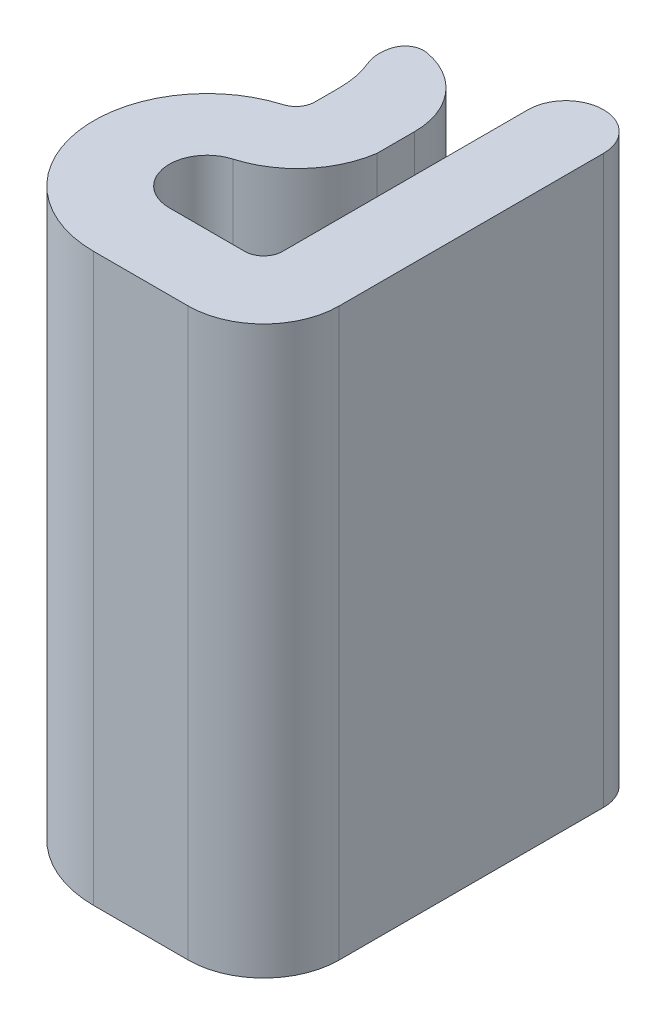
ISO-10303-21;
HEADER;
FILE_DESCRIPTION(('STEP AP214'),'2;1');
FILE_NAME('part.step','',(''),(''),'','','');
FILE_SCHEMA(('AUTOMOTIVE_DESIGN { 1 0 10303 214 1 1 1 1 }'));
ENDSEC;
DATA;
#1=APPLICATION_CONTEXT('core data for automotive mechanical design processes');
#2=APPLICATION_PROTOCOL_DEFINITION('international standard','automotive_design',2000,#1);
#3=PRODUCT_CONTEXT('',#1,'mechanical');
#4=PRODUCT('Part','Part','',(#3));
#5=PRODUCT_RELATED_PRODUCT_CATEGORY('part','',(#4));
#6=PRODUCT_DEFINITION_FORMATION('','',#4);
#7=PRODUCT_DEFINITION_CONTEXT('part definition',#1,'design');
#8=PRODUCT_DEFINITION('design','',#6,#7);
#9=PRODUCT_DEFINITION_SHAPE('','',#8);
#10=(LENGTH_UNIT() NAMED_UNIT(*) SI_UNIT(.MILLI.,.METRE.));
#11=(NAMED_UNIT(*) PLANE_ANGLE_UNIT() SI_UNIT($,.RADIAN.));
#12=(NAMED_UNIT(*) SI_UNIT($,.STERADIAN.) SOLID_ANGLE_UNIT());
#13=UNCERTAINTY_MEASURE_WITH_UNIT(LENGTH_MEASURE(1.E-05),#10,'distance_accuracy_value','');
#14=(GEOMETRIC_REPRESENTATION_CONTEXT(3) GLOBAL_UNCERTAINTY_ASSIGNED_CONTEXT((#13)) GLOBAL_UNIT_ASSIGNED_CONTEXT((#10,
#11,#12)) REPRESENTATION_CONTEXT('',''));
#15=CARTESIAN_POINT('',(0.,0.,0.));
#16=DIRECTION('',(0.,0.,1.));
#17=DIRECTION('',(1.,0.,0.));
#18=AXIS2_PLACEMENT_3D('',#15,#16,#17);
#19=CARTESIAN_POINT('',(33.25,24.,39.));
#20=DIRECTION('',(-1.,0.,0.));
#21=DIRECTION('',(0.,-1.,0.));
#22=AXIS2_PLACEMENT_3D('',#19,#20,#21);
#23=PLANE('',#22);
#24=DIRECTION('',(0.,0.,-1.));
#25=VECTOR('',#24,1.);
#26=CARTESIAN_POINT('',(33.25,24.,39.));
#27=LINE('',#26,#25);
#28=CARTESIAN_POINT('',(33.25,24.,39.));
#29=VERTEX_POINT('',#28);
#30=CARTESIAN_POINT('',(33.25,24.,32.5));
#31=VERTEX_POINT('',#30);
#32=EDGE_CURVE('E180',#29,#31,#27,.T.);
#33=ORIENTED_EDGE('',*,*,#32,.T.);
#34=DIRECTION('',(0.,-1.,0.));
#35=VECTOR('',#34,1.);
#36=CARTESIAN_POINT('',(33.25,24.,32.5));
#37=LINE('',#36,#35);
#38=CARTESIAN_POINT('',(33.25,9.,32.5));
#39=VERTEX_POINT('',#38);
#40=EDGE_CURVE('E294',#31,#39,#37,.T.);
#41=ORIENTED_EDGE('',*,*,#40,.T.);
#42=DIRECTION('',(0.,0.,-1.));
#43=VECTOR('',#42,1.);
#44=CARTESIAN_POINT('',(33.25,9.,39.));
#45=LINE('',#44,#43);
#46=CARTESIAN_POINT('',(33.25,9.,39.));
#47=VERTEX_POINT('',#46);
#48=EDGE_CURVE('E216',#47,#39,#45,.T.);
#49=ORIENTED_EDGE('',*,*,#48,.F.);
#50=DIRECTION('',(0.,-1.,0.));
#51=VECTOR('',#50,1.);
#52=CARTESIAN_POINT('',(33.25,24.,39.));
#53=LINE('',#52,#51);
#54=EDGE_CURVE('E256',#29,#47,#53,.T.);
#55=ORIENTED_EDGE('',*,*,#54,.F.);
#56=EDGE_LOOP('',(#33,#41,#49,#55));
#57=FACE_BOUND('',#56,.T.);
#58=ADVANCED_FACE('F35',(#57),#23,.T.);
#59=CARTESIAN_POINT('',(32.75,24.,39.));
#60=DIRECTION('',(0.,-1.,0.));
#61=DIRECTION('',(1.,0.,0.));
#62=AXIS2_PLACEMENT_3D('',#59,#60,#61);
#63=CYLINDRICAL_SURFACE('',#62,0.5);
#64=ORIENTED_EDGE('',*,*,#54,.T.);
#65=CARTESIAN_POINT('',(32.75,9.,39.));
#66=DIRECTION('',(0.,1.,0.));
#67=DIRECTION('',(1.,0.,0.));
#68=AXIS2_PLACEMENT_3D('',#65,#66,#67);
#69=CIRCLE('',#68,0.5);
#70=CARTESIAN_POINT('',(32.75,9.,39.5));
#71=VERTEX_POINT('',#70);
#72=EDGE_CURVE('E213',#71,#47,#69,.T.);
#73=ORIENTED_EDGE('',*,*,#72,.F.);
#74=DIRECTION('',(0.,-1.,0.));
#75=VECTOR('',#74,1.);
#76=CARTESIAN_POINT('',(32.75,24.,39.5));
#77=LINE('',#76,#75);
#78=CARTESIAN_POINT('',(32.75,24.,39.5));
#79=VERTEX_POINT('',#78);
#80=EDGE_CURVE('E259',#79,#71,#77,.T.);
#81=ORIENTED_EDGE('',*,*,#80,.F.);
#82=CARTESIAN_POINT('',(32.75,24.,39.));
#83=DIRECTION('',(0.,1.,0.));
#84=DIRECTION('',(1.,0.,0.));
#85=AXIS2_PLACEMENT_3D('',#82,#83,#84);
#86=CIRCLE('',#85,0.5);
#87=EDGE_CURVE('E251',#79,#29,#86,.T.);
#88=ORIENTED_EDGE('',*,*,#87,.T.);
#89=EDGE_LOOP('',(#64,#73,#81,#88));
#90=FACE_BOUND('',#89,.T.);
#91=ADVANCED_FACE('F338',(#90),#63,.F.);
#92=CARTESIAN_POINT('',(30.7500000000001,24.,39.5));
#93=DIRECTION('',(0.,0.,-1.));
#94=DIRECTION('',(-1.,0.,0.));
#95=AXIS2_PLACEMENT_3D('',#92,#93,#94);
#96=PLANE('',#95);
#97=ORIENTED_EDGE('',*,*,#80,.T.);
#98=DIRECTION('',(1.,0.,0.));
#99=VECTOR('',#98,1.);
#100=CARTESIAN_POINT('',(30.7500000000001,9.,39.5));
#101=LINE('',#100,#99);
#102=CARTESIAN_POINT('',(30.7500000000001,9.,39.5));
#103=VERTEX_POINT('',#102);
#104=EDGE_CURVE('E210',#103,#71,#101,.T.);
#105=ORIENTED_EDGE('',*,*,#104,.F.);
#106=DIRECTION('',(0.,-1.,0.));
#107=VECTOR('',#106,1.);
#108=CARTESIAN_POINT('',(30.7500000000001,24.,39.5));
#109=LINE('',#108,#107);
#110=CARTESIAN_POINT('',(30.7500000000001,24.,39.5));
#111=VERTEX_POINT('',#110);
#112=EDGE_CURVE('E261',#111,#103,#109,.T.);
#113=ORIENTED_EDGE('',*,*,#112,.F.);
#114=DIRECTION('',(1.,0.,0.));
#115=VECTOR('',#114,1.);
#116=CARTESIAN_POINT('',(30.7500000000001,24.,39.5));
#117=LINE('',#116,#115);
#118=EDGE_CURVE('E248',#111,#79,#117,.T.);
#119=ORIENTED_EDGE('',*,*,#118,.T.);
#120=EDGE_LOOP('',(#97,#105,#113,#119));
#121=FACE_BOUND('',#120,.T.);
#122=ADVANCED_FACE('F344',(#121),#96,.T.);
#123=CARTESIAN_POINT('',(30.7500000000001,24.,38.5));
#124=DIRECTION('',(0.,-1.,0.));
#125=DIRECTION('',(1.,0.,0.));
#126=AXIS2_PLACEMENT_3D('',#123,#124,#125);
#127=CYLINDRICAL_SURFACE('',#126,1.);
#128=ORIENTED_EDGE('',*,*,#112,.T.);
#129=CARTESIAN_POINT('',(30.7500000000001,9.,38.5));
#130=DIRECTION('',(0.,1.,0.));
#131=DIRECTION('',(-1.,0.,0.));
#132=AXIS2_PLACEMENT_3D('',#129,#130,#131);
#133=CIRCLE('',#132,1.);
#134=CARTESIAN_POINT('',(30.4718068405259,9.,37.5394748488344));
#135=VERTEX_POINT('',#134);
#136=EDGE_CURVE('E207',#135,#103,#133,.T.);
#137=ORIENTED_EDGE('',*,*,#136,.F.);
#138=DIRECTION('',(0.,-1.,0.));
#139=VECTOR('',#138,1.);
#140=CARTESIAN_POINT('',(30.4718068405259,24.,37.5394748488344));
#141=LINE('',#140,#139);
#142=CARTESIAN_POINT('',(30.4718068405259,24.,37.5394748488344));
#143=VERTEX_POINT('',#142);
#144=EDGE_CURVE('E263',#143,#135,#141,.T.);
#145=ORIENTED_EDGE('',*,*,#144,.F.);
#146=CARTESIAN_POINT('',(30.7500000000001,24.,38.5));
#147=DIRECTION('',(0.,1.,0.));
#148=DIRECTION('',(-1.,0.,0.));
#149=AXIS2_PLACEMENT_3D('',#146,#147,#148);
#150=CIRCLE('',#149,1.);
#151=EDGE_CURVE('E245',#143,#111,#150,.T.);
#152=ORIENTED_EDGE('',*,*,#151,.T.);
#153=EDGE_LOOP('',(#128,#137,#145,#152));
#154=FACE_BOUND('',#153,.T.);
#155=ADVANCED_FACE('F352',(#154),#127,.F.);
#156=CARTESIAN_POINT('',(29.7763239418405,24.,35.1381619709202));
#157=DIRECTION('',(0.,-1.,0.));
#158=DIRECTION('',(1.,0.,0.));
#159=AXIS2_PLACEMENT_3D('',#156,#157,#158);
#160=CYLINDRICAL_SURFACE('',#159,2.5);
#161=ORIENTED_EDGE('',*,*,#144,.T.);
#162=CARTESIAN_POINT('',(29.7763239418405,9.,35.1381619709202));
#163=DIRECTION('',(0.,-1.,0.));
#164=DIRECTION('',(-1.,0.,0.));
#165=AXIS2_PLACEMENT_3D('',#162,#163,#164);
#166=CIRCLE('',#165,2.5);
#167=CARTESIAN_POINT('',(32.2500000000001,9.,35.5));
#168=VERTEX_POINT('',#167);
#169=EDGE_CURVE('E204',#168,#135,#166,.T.);
#170=ORIENTED_EDGE('',*,*,#169,.F.);
#171=DIRECTION('',(0.,-1.,0.));
#172=VECTOR('',#171,1.);
#173=CARTESIAN_POINT('',(32.2500000000001,24.,35.5));
#174=LINE('',#173,#172);
#175=CARTESIAN_POINT('',(32.2500000000001,24.,35.5));
#176=VERTEX_POINT('',#175);
#177=EDGE_CURVE('E265',#176,#168,#174,.T.);
#178=ORIENTED_EDGE('',*,*,#177,.F.);
#179=CARTESIAN_POINT('',(29.7763239418405,24.,35.1381619709202));
#180=DIRECTION('',(0.,-1.,0.));
#181=DIRECTION('',(-1.,0.,0.));
#182=AXIS2_PLACEMENT_3D('',#179,#180,#181);
#183=CIRCLE('',#182,2.5);
#184=EDGE_CURVE('E242',#176,#143,#183,.T.);
#185=ORIENTED_EDGE('',*,*,#184,.T.);
#186=EDGE_LOOP('',(#161,#170,#178,#185));
#187=FACE_BOUND('',#186,.T.);
#188=ADVANCED_FACE('F356',(#187),#160,.T.);
#189=CARTESIAN_POINT('',(32.2500000000001,24.,34.5));
#190=DIRECTION('',(1.,0.,0.));
#191=DIRECTION('',(0.,1.,0.));
#192=AXIS2_PLACEMENT_3D('',#189,#190,#191);
#193=PLANE('',#192);
#194=ORIENTED_EDGE('',*,*,#177,.T.);
#195=DIRECTION('',(0.,0.,1.));
#196=VECTOR('',#195,1.);
#197=CARTESIAN_POINT('',(32.2500000000001,9.,34.5));
#198=LINE('',#197,#196);
#199=CARTESIAN_POINT('',(32.2500000000001,9.,34.5));
#200=VERTEX_POINT('',#199);
#201=EDGE_CURVE('E201',#200,#168,#198,.T.);
#202=ORIENTED_EDGE('',*,*,#201,.F.);
#203=DIRECTION('',(0.,-1.,0.));
#204=VECTOR('',#203,1.);
#205=CARTESIAN_POINT('',(32.2500000000001,24.,34.5));
#206=LINE('',#205,#204);
#207=CARTESIAN_POINT('',(32.2500000000001,24.,34.5));
#208=VERTEX_POINT('',#207);
#209=EDGE_CURVE('E267',#208,#200,#206,.T.);
#210=ORIENTED_EDGE('',*,*,#209,.F.);
#211=DIRECTION('',(0.,0.,1.));
#212=VECTOR('',#211,1.);
#213=CARTESIAN_POINT('',(32.2500000000001,24.,34.5));
#214=LINE('',#213,#212);
#215=EDGE_CURVE('E239',#208,#176,#214,.T.);
#216=ORIENTED_EDGE('',*,*,#215,.T.);
#217=EDGE_LOOP('',(#194,#202,#210,#216));
#218=FACE_BOUND('',#217,.T.);
#219=ADVANCED_FACE('F360',(#218),#193,.T.);
#220=CARTESIAN_POINT('',(30.25,24.,34.5));
#221=DIRECTION('',(0.,-1.,0.));
#222=DIRECTION('',(1.,0.,0.));
#223=AXIS2_PLACEMENT_3D('',#220,#221,#222);
#224=CYLINDRICAL_SURFACE('',#223,2.);
#225=CARTESIAN_POINT('',(30.25,9.,34.5));
#226=DIRECTION('',(0.,-1.,0.));
#227=DIRECTION('',(-1.,0.,0.));
#228=AXIS2_PLACEMENT_3D('',#225,#226,#227);
#229=CIRCLE('',#228,2.);
#230=CARTESIAN_POINT('',(30.5996134893419,9.,32.5307944728723));
#231=VERTEX_POINT('',#230);
#232=EDGE_CURVE('E199',#231,#200,#229,.T.);
#233=ORIENTED_EDGE('',*,*,#232,.F.);
#234=DIRECTION('',(0.,-1.,0.));
#235=VECTOR('',#234,1.);
#236=CARTESIAN_POINT('',(30.5996134893419,24.,32.5307944728723));
#237=LINE('',#236,#235);
#238=CARTESIAN_POINT('',(30.5996134893419,24.,32.5307944728723));
#239=VERTEX_POINT('',#238);
#240=EDGE_CURVE('E43',#231,#239,#237,.F.);
#241=ORIENTED_EDGE('',*,*,#240,.T.);
#242=CARTESIAN_POINT('',(30.25,24.,34.5));
#243=DIRECTION('',(0.,-1.,0.));
#244=DIRECTION('',(-1.,0.,0.));
#245=AXIS2_PLACEMENT_3D('',#242,#243,#244);
#246=CIRCLE('',#245,2.);
#247=EDGE_CURVE('E237',#239,#208,#246,.T.);
#248=ORIENTED_EDGE('',*,*,#247,.T.);
#249=ORIENTED_EDGE('',*,*,#209,.T.);
#250=EDGE_LOOP('',(#233,#241,#248,#249));
#251=FACE_BOUND('',#250,.T.);
#252=ADVANCED_FACE('F364',(#251),#224,.T.);
#253=CARTESIAN_POINT('',(27.7500000000001,24.,34.5));
#254=DIRECTION('',(0.,-1.,0.));
#255=DIRECTION('',(1.,0.,0.));
#256=AXIS2_PLACEMENT_3D('',#253,#254,#255);
#257=CYLINDRICAL_SURFACE('',#256,2.5);
#258=CARTESIAN_POINT('',(27.7500000000001,24.,34.5));
#259=DIRECTION('',(0.,1.,0.));
#260=DIRECTION('',(-1.,0.,0.));
#261=AXIS2_PLACEMENT_3D('',#258,#259,#260);
#262=CIRCLE('',#261,2.5);
#263=CARTESIAN_POINT('',(30.2500000000001,24.,34.5));
#264=VERTEX_POINT('',#263);
#265=CARTESIAN_POINT('',(30.0635578620444,24.,33.5526616132698));
#266=VERTEX_POINT('',#265);
#267=EDGE_CURVE('E234',#264,#266,#262,.T.);
#268=ORIENTED_EDGE('',*,*,#267,.T.);
#269=DIRECTION('',(0.,-1.,0.));
#270=VECTOR('',#269,1.);
#271=CARTESIAN_POINT('',(30.0635578620444,24.,33.5526616132698));
#272=LINE('',#271,#270);
#273=CARTESIAN_POINT('',(30.0635578620444,9.,33.5526616132698));
#274=VERTEX_POINT('',#273);
#275=EDGE_CURVE('E258',#266,#274,#272,.T.);
#276=ORIENTED_EDGE('',*,*,#275,.T.);
#277=CARTESIAN_POINT('',(27.7500000000001,9.,34.5));
#278=DIRECTION('',(0.,1.,0.));
#279=DIRECTION('',(-1.,0.,0.));
#280=AXIS2_PLACEMENT_3D('',#277,#278,#279);
#281=CIRCLE('',#280,2.5);
#282=CARTESIAN_POINT('',(30.2500000000001,9.,34.5));
#283=VERTEX_POINT('',#282);
#284=EDGE_CURVE('E196',#283,#274,#281,.T.);
#285=ORIENTED_EDGE('',*,*,#284,.F.);
#286=DIRECTION('',(0.,-1.,0.));
#287=VECTOR('',#286,1.);
#288=CARTESIAN_POINT('',(30.2500000000001,24.,34.5));
#289=LINE('',#288,#287);
#290=EDGE_CURVE('E270',#264,#283,#289,.T.);
#291=ORIENTED_EDGE('',*,*,#290,.F.);
#292=EDGE_LOOP('',(#268,#276,#285,#291));
#293=FACE_BOUND('',#292,.T.);
#294=ADVANCED_FACE('F311',(#293),#257,.F.);
#295=CARTESIAN_POINT('',(30.2500000000001,24.,34.5));
#296=DIRECTION('',(-1.,0.,0.));
#297=DIRECTION('',(0.,-1.,0.));
#298=AXIS2_PLACEMENT_3D('',#295,#296,#297);
#299=PLANE('',#298);
#300=ORIENTED_EDGE('',*,*,#290,.T.);
#301=DIRECTION('',(0.,0.,-1.));
#302=VECTOR('',#301,1.);
#303=CARTESIAN_POINT('',(30.2500000000001,9.,34.5));
#304=LINE('',#303,#302);
#305=CARTESIAN_POINT('',(30.2500000000001,9.,35.1458980337503));
#306=VERTEX_POINT('',#305);
#307=EDGE_CURVE('E193',#306,#283,#304,.T.);
#308=ORIENTED_EDGE('',*,*,#307,.F.);
#309=DIRECTION('',(0.,-1.,0.));
#310=VECTOR('',#309,1.);
#311=CARTESIAN_POINT('',(30.2500000000001,24.,35.1458980337503));
#312=LINE('',#311,#310);
#313=CARTESIAN_POINT('',(30.2500000000001,24.,35.1458980337503));
#314=VERTEX_POINT('',#313);
#315=EDGE_CURVE('E272',#314,#306,#312,.T.);
#316=ORIENTED_EDGE('',*,*,#315,.F.);
#317=DIRECTION('',(0.,0.,-1.));
#318=VECTOR('',#317,1.);
#319=CARTESIAN_POINT('',(30.2500000000001,24.,34.5));
#320=LINE('',#319,#318);
#321=EDGE_CURVE('E231',#314,#264,#320,.T.);
#322=ORIENTED_EDGE('',*,*,#321,.T.);
#323=EDGE_LOOP('',(#300,#308,#316,#322));
#324=FACE_BOUND('',#323,.T.);
#325=ADVANCED_FACE('F318',(#324),#299,.T.);
#326=CARTESIAN_POINT('',(29.7500000000001,24.,35.1458980337503));
#327=DIRECTION('',(0.,-1.,0.));
#328=DIRECTION('',(1.,0.,0.));
#329=AXIS2_PLACEMENT_3D('',#326,#327,#328);
#330=CYLINDRICAL_SURFACE('',#329,0.500000000000001);
#331=ORIENTED_EDGE('',*,*,#315,.T.);
#332=CARTESIAN_POINT('',(29.7500000000001,9.,35.1458980337503));
#333=DIRECTION('',(0.,1.,0.));
#334=DIRECTION('',(1.,0.,0.));
#335=AXIS2_PLACEMENT_3D('',#332,#333,#334);
#336=CIRCLE('',#335,0.500000000000001);
#337=CARTESIAN_POINT('',(29.8928571428572,9.,35.6250554575003));
#338=VERTEX_POINT('',#337);
#339=EDGE_CURVE('E190',#338,#306,#336,.T.);
#340=ORIENTED_EDGE('',*,*,#339,.F.);
#341=DIRECTION('',(0.,-1.,0.));
#342=VECTOR('',#341,1.);
#343=CARTESIAN_POINT('',(29.8928571428572,24.,35.6250554575003));
#344=LINE('',#343,#342);
#345=CARTESIAN_POINT('',(29.8928571428572,24.,35.6250554575003));
#346=VERTEX_POINT('',#345);
#347=EDGE_CURVE('E274',#346,#338,#344,.T.);
#348=ORIENTED_EDGE('',*,*,#347,.F.);
#349=CARTESIAN_POINT('',(29.7500000000001,24.,35.1458980337503));
#350=DIRECTION('',(0.,1.,0.));
#351=DIRECTION('',(1.,0.,0.));
#352=AXIS2_PLACEMENT_3D('',#349,#350,#351);
#353=CIRCLE('',#352,0.500000000000001);
#354=EDGE_CURVE('E228',#346,#314,#353,.T.);
#355=ORIENTED_EDGE('',*,*,#354,.T.);
#356=EDGE_LOOP('',(#331,#340,#348,#355));
#357=FACE_BOUND('',#356,.T.);
#358=ADVANCED_FACE('F321',(#357),#330,.F.);
#359=CARTESIAN_POINT('',(30.7500000000001,24.,38.5));
#360=DIRECTION('',(0.,-1.,0.));
#361=DIRECTION('',(1.,0.,0.));
#362=AXIS2_PLACEMENT_3D('',#359,#360,#361);
#363=CYLINDRICAL_SURFACE('',#362,3.);
#364=ORIENTED_EDGE('',*,*,#347,.T.);
#365=CARTESIAN_POINT('',(30.7500000000001,9.,38.5));
#366=DIRECTION('',(0.,-1.,0.));
#367=DIRECTION('',(1.,0.,0.));
#368=AXIS2_PLACEMENT_3D('',#365,#366,#367);
#369=CIRCLE('',#368,3.);
#370=CARTESIAN_POINT('',(30.7500000000001,9.,41.5));
#371=VERTEX_POINT('',#370);
#372=EDGE_CURVE('E185',#371,#338,#369,.T.);
#373=ORIENTED_EDGE('',*,*,#372,.F.);
#374=DIRECTION('',(0.,-1.,0.));
#375=VECTOR('',#374,1.);
#376=CARTESIAN_POINT('',(30.7500000000001,24.,41.5));
#377=LINE('',#376,#375);
#378=CARTESIAN_POINT('',(30.7500000000001,24.,41.5));
#379=VERTEX_POINT('',#378);
#380=EDGE_CURVE('E276',#379,#371,#377,.T.);
#381=ORIENTED_EDGE('',*,*,#380,.F.);
#382=CARTESIAN_POINT('',(30.7500000000001,24.,38.5));
#383=DIRECTION('',(0.,-1.,0.));
#384=DIRECTION('',(1.,0.,0.));
#385=AXIS2_PLACEMENT_3D('',#382,#383,#384);
#386=CIRCLE('',#385,3.);
#387=EDGE_CURVE('E225',#379,#346,#386,.T.);
#388=ORIENTED_EDGE('',*,*,#387,.T.);
#389=EDGE_LOOP('',(#364,#373,#381,#388));
#390=FACE_BOUND('',#389,.T.);
#391=ADVANCED_FACE('F324',(#390),#363,.T.);
#392=CARTESIAN_POINT('',(33.2500000000001,24.,41.5));
#393=DIRECTION('',(0.,0.,1.));
#394=DIRECTION('',(1.,0.,0.));
#395=AXIS2_PLACEMENT_3D('',#392,#393,#394);
#396=PLANE('',#395);
#397=ORIENTED_EDGE('',*,*,#380,.T.);
#398=DIRECTION('',(-1.,0.,0.));
#399=VECTOR('',#398,1.);
#400=CARTESIAN_POINT('',(33.2500000000001,9.,41.5));
#401=LINE('',#400,#399);
#402=CARTESIAN_POINT('',(33.2500000000001,9.,41.5));
#403=VERTEX_POINT('',#402);
#404=EDGE_CURVE('E183',#403,#371,#401,.T.);
#405=ORIENTED_EDGE('',*,*,#404,.F.);
#406=DIRECTION('',(0.,-1.,0.));
#407=VECTOR('',#406,1.);
#408=CARTESIAN_POINT('',(33.2500000000001,24.,41.5));
#409=LINE('',#408,#407);
#410=CARTESIAN_POINT('',(33.2500000000001,24.,41.5));
#411=VERTEX_POINT('',#410);
#412=EDGE_CURVE('E179',#411,#403,#409,.T.);
#413=ORIENTED_EDGE('',*,*,#412,.F.);
#414=DIRECTION('',(-1.,0.,0.));
#415=VECTOR('',#414,1.);
#416=CARTESIAN_POINT('',(33.2500000000001,24.,41.5));
#417=LINE('',#416,#415);
#418=EDGE_CURVE('E222',#411,#379,#417,.T.);
#419=ORIENTED_EDGE('',*,*,#418,.T.);
#420=EDGE_LOOP('',(#397,#405,#413,#419));
#421=FACE_BOUND('',#420,.T.);
#422=ADVANCED_FACE('F328',(#421),#396,.T.);
#423=CARTESIAN_POINT('',(33.2500000000001,24.,39.5));
#424=DIRECTION('',(0.,-1.,0.));
#425=DIRECTION('',(1.,0.,0.));
#426=AXIS2_PLACEMENT_3D('',#423,#424,#425);
#427=CYLINDRICAL_SURFACE('',#426,1.99999999999999);
#428=ORIENTED_EDGE('',*,*,#412,.T.);
#429=CARTESIAN_POINT('',(33.2500000000001,9.,39.5));
#430=DIRECTION('',(0.,-1.,0.));
#431=DIRECTION('',(1.,0.,0.));
#432=AXIS2_PLACEMENT_3D('',#429,#430,#431);
#433=CIRCLE('',#432,1.99999999999999);
#434=CARTESIAN_POINT('',(35.25,9.,39.5));
#435=VERTEX_POINT('',#434);
#436=EDGE_CURVE('E162',#435,#403,#433,.T.);
#437=ORIENTED_EDGE('',*,*,#436,.F.);
#438=DIRECTION('',(0.,-1.,0.));
#439=VECTOR('',#438,1.);
#440=CARTESIAN_POINT('',(35.25,24.,39.5));
#441=LINE('',#440,#439);
#442=CARTESIAN_POINT('',(35.25,24.,39.5));
#443=VERTEX_POINT('',#442);
#444=EDGE_CURVE('E172',#443,#435,#441,.T.);
#445=ORIENTED_EDGE('',*,*,#444,.F.);
#446=CARTESIAN_POINT('',(33.2500000000001,24.,39.5));
#447=DIRECTION('',(0.,-1.,0.));
#448=DIRECTION('',(1.,0.,0.));
#449=AXIS2_PLACEMENT_3D('',#446,#447,#448);
#450=CIRCLE('',#449,1.99999999999999);
#451=EDGE_CURVE('E220',#443,#411,#450,.T.);
#452=ORIENTED_EDGE('',*,*,#451,.T.);
#453=EDGE_LOOP('',(#428,#437,#445,#452));
#454=FACE_BOUND('',#453,.T.);
#455=ADVANCED_FACE('F182',(#454),#427,.T.);
#456=CARTESIAN_POINT('',(35.25,24.,31.5));
#457=DIRECTION('',(1.,0.,0.));
#458=DIRECTION('',(0.,1.,0.));
#459=AXIS2_PLACEMENT_3D('',#456,#457,#458);
#460=PLANE('',#459);
#461=DIRECTION('',(0.,0.,1.));
#462=VECTOR('',#461,1.);
#463=CARTESIAN_POINT('',(35.25,9.,31.5));
#464=LINE('',#463,#462);
#465=CARTESIAN_POINT('',(35.25,9.,32.5));
#466=VERTEX_POINT('',#465);
#467=EDGE_CURVE('E157',#466,#435,#464,.T.);
#468=ORIENTED_EDGE('',*,*,#467,.F.);
#469=DIRECTION('',(0.,-1.,0.));
#470=VECTOR('',#469,1.);
#471=CARTESIAN_POINT('',(35.25,24.,32.5));
#472=LINE('',#471,#470);
#473=CARTESIAN_POINT('',(35.25,24.,32.5));
#474=VERTEX_POINT('',#473);
#475=EDGE_CURVE('E288',#466,#474,#472,.F.);
#476=ORIENTED_EDGE('',*,*,#475,.T.);
#477=DIRECTION('',(0.,0.,1.));
#478=VECTOR('',#477,1.);
#479=CARTESIAN_POINT('',(35.25,24.,31.5));
#480=LINE('',#479,#478);
#481=EDGE_CURVE('E175',#474,#443,#480,.T.);
#482=ORIENTED_EDGE('',*,*,#481,.T.);
#483=ORIENTED_EDGE('',*,*,#444,.T.);
#484=EDGE_LOOP('',(#468,#476,#482,#483));
#485=FACE_BOUND('',#484,.T.);
#486=ADVANCED_FACE('F173',(#485),#460,.T.);
#487=CARTESIAN_POINT('',(33.2500000000001,24.,39.5));
#488=DIRECTION('',(0.,-1.,0.));
#489=DIRECTION('',(1.,0.,0.));
#490=AXIS2_PLACEMENT_3D('',#487,#488,#489);
#491=PLANE('',#490);
#492=ORIENTED_EDGE('',*,*,#247,.F.);
#493=CARTESIAN_POINT('',(30.5122101170064,24.,33.0230958546542));
#494=DIRECTION('',(0.,-1.,0.));
#495=DIRECTION('',(1.,0.,0.));
#496=AXIS2_PLACEMENT_3D('',#493,#494,#495);
#497=CIRCLE('',#496,0.5);
#498=CARTESIAN_POINT('',(30.0354392271506,24.,32.8724654507308));
#499=VERTEX_POINT('',#498);
#500=EDGE_CURVE('E11',#239,#499,#497,.F.);
#501=ORIENTED_EDGE('',*,*,#500,.T.);
#502=CARTESIAN_POINT('',(30.9889810068622,24.,33.1737262585777));
#503=DIRECTION('',(0.,-1.,0.));
#504=DIRECTION('',(1.,0.,0.));
#505=AXIS2_PLACEMENT_3D('',#502,#503,#504);
#506=CIRCLE('',#505,1.);
#507=EDGE_CURVE('E283',#499,#266,#506,.F.);
#508=ORIENTED_EDGE('',*,*,#507,.T.);
#509=ORIENTED_EDGE('',*,*,#267,.F.);
#510=ORIENTED_EDGE('',*,*,#321,.F.);
#511=ORIENTED_EDGE('',*,*,#354,.F.);
#512=ORIENTED_EDGE('',*,*,#387,.F.);
#513=ORIENTED_EDGE('',*,*,#418,.F.);
#514=ORIENTED_EDGE('',*,*,#451,.F.);
#515=ORIENTED_EDGE('',*,*,#481,.F.);
#516=CARTESIAN_POINT('',(34.25,24.,32.5));
#517=DIRECTION('',(0.,-1.,0.));
#518=DIRECTION('',(1.,0.,0.));
#519=AXIS2_PLACEMENT_3D('',#516,#517,#518);
#520=CIRCLE('',#519,1.);
#521=CARTESIAN_POINT('',(34.25,24.,31.5));
#522=VERTEX_POINT('',#521);
#523=EDGE_CURVE('E292',#474,#522,#520,.F.);
#524=ORIENTED_EDGE('',*,*,#523,.T.);
#525=CARTESIAN_POINT('',(34.25,24.,32.5));
#526=DIRECTION('',(0.,-1.,0.));
#527=DIRECTION('',(1.,0.,0.));
#528=AXIS2_PLACEMENT_3D('',#525,#526,#527);
#529=CIRCLE('',#528,1.);
#530=EDGE_CURVE('E290',#522,#31,#529,.F.);
#531=ORIENTED_EDGE('',*,*,#530,.T.);
#532=ORIENTED_EDGE('',*,*,#32,.F.);
#533=ORIENTED_EDGE('',*,*,#87,.F.);
#534=ORIENTED_EDGE('',*,*,#118,.F.);
#535=ORIENTED_EDGE('',*,*,#151,.F.);
#536=ORIENTED_EDGE('',*,*,#184,.F.);
#537=ORIENTED_EDGE('',*,*,#215,.F.);
#538=EDGE_LOOP('',(#492,#501,#508,#509,#510,#511,#512,#513,#514,#515,#524,#531,#532,#533,#534,
#535,#536,#537));
#539=FACE_BOUND('',#538,.T.);
#540=ADVANCED_FACE('F315',(#539),#491,.F.);
#541=CARTESIAN_POINT('',(33.2500000000001,9.,39.5));
#542=DIRECTION('',(0.,-1.,0.));
#543=DIRECTION('',(1.,0.,0.));
#544=AXIS2_PLACEMENT_3D('',#541,#542,#543);
#545=PLANE('',#544);
#546=CARTESIAN_POINT('',(30.9889810068622,9.,33.1737262585777));
#547=DIRECTION('',(0.,-1.,0.));
#548=DIRECTION('',(1.,0.,0.));
#549=AXIS2_PLACEMENT_3D('',#546,#547,#548);
#550=CIRCLE('',#549,1.);
#551=CARTESIAN_POINT('',(30.0354392271506,9.,32.8724654507308));
#552=VERTEX_POINT('',#551);
#553=EDGE_CURVE('E281',#274,#552,#550,.T.);
#554=ORIENTED_EDGE('',*,*,#553,.T.);
#555=CARTESIAN_POINT('',(30.5122101170064,9.,33.0230958546542));
#556=DIRECTION('',(0.,-1.,0.));
#557=DIRECTION('',(1.,0.,0.));
#558=AXIS2_PLACEMENT_3D('',#555,#556,#557);
#559=CIRCLE('',#558,0.5);
#560=EDGE_CURVE('E57',#552,#231,#559,.T.);
#561=ORIENTED_EDGE('',*,*,#560,.T.);
#562=ORIENTED_EDGE('',*,*,#232,.T.);
#563=ORIENTED_EDGE('',*,*,#201,.T.);
#564=ORIENTED_EDGE('',*,*,#169,.T.);
#565=ORIENTED_EDGE('',*,*,#136,.T.);
#566=ORIENTED_EDGE('',*,*,#104,.T.);
#567=ORIENTED_EDGE('',*,*,#72,.T.);
#568=ORIENTED_EDGE('',*,*,#48,.T.);
#569=CARTESIAN_POINT('',(34.25,9.,32.5));
#570=DIRECTION('',(0.,-1.,0.));
#571=DIRECTION('',(1.,0.,0.));
#572=AXIS2_PLACEMENT_3D('',#569,#570,#571);
#573=CIRCLE('',#572,1.);
#574=CARTESIAN_POINT('',(34.25,9.,31.5));
#575=VERTEX_POINT('',#574);
#576=EDGE_CURVE('E285',#39,#575,#573,.T.);
#577=ORIENTED_EDGE('',*,*,#576,.T.);
#578=CARTESIAN_POINT('',(34.25,9.,32.5));
#579=DIRECTION('',(0.,-1.,0.));
#580=DIRECTION('',(1.,0.,0.));
#581=AXIS2_PLACEMENT_3D('',#578,#579,#580);
#582=CIRCLE('',#581,1.);
#583=EDGE_CURVE('E165',#575,#466,#582,.T.);
#584=ORIENTED_EDGE('',*,*,#583,.T.);
#585=ORIENTED_EDGE('',*,*,#467,.T.);
#586=ORIENTED_EDGE('',*,*,#436,.T.);
#587=ORIENTED_EDGE('',*,*,#404,.T.);
#588=ORIENTED_EDGE('',*,*,#372,.T.);
#589=ORIENTED_EDGE('',*,*,#339,.T.);
#590=ORIENTED_EDGE('',*,*,#307,.T.);
#591=ORIENTED_EDGE('',*,*,#284,.T.);
#592=EDGE_LOOP('',(#554,#561,#562,#563,#564,#565,#566,#567,#568,#577,#584,#585,#586,#587,#588,
#589,#590,#591));
#593=FACE_BOUND('',#592,.T.);
#594=ADVANCED_FACE('F159',(#593),#545,.T.);
#595=CARTESIAN_POINT('',(30.9889810068622,24.,33.1737262585777));
#596=DIRECTION('',(0.,-1.,0.));
#597=DIRECTION('',(1.,0.,0.));
#598=AXIS2_PLACEMENT_3D('',#595,#596,#597);
#599=CYLINDRICAL_SURFACE('',#598,1.);
#600=ORIENTED_EDGE('',*,*,#507,.F.);
#601=DIRECTION('',(0.,-1.,0.));
#602=VECTOR('',#601,1.);
#603=CARTESIAN_POINT('',(30.0354392271506,24.,32.8724654507308));
#604=LINE('',#603,#602);
#605=EDGE_CURVE('E296',#499,#552,#604,.T.);
#606=ORIENTED_EDGE('',*,*,#605,.T.);
#607=ORIENTED_EDGE('',*,*,#553,.F.);
#608=ORIENTED_EDGE('',*,*,#275,.F.);
#609=EDGE_LOOP('',(#600,#606,#607,#608));
#610=FACE_BOUND('',#609,.T.);
#611=ADVANCED_FACE('F304',(#610),#599,.T.);
#612=CARTESIAN_POINT('',(34.25,24.,32.5));
#613=DIRECTION('',(0.,-1.,0.));
#614=DIRECTION('',(1.,0.,0.));
#615=AXIS2_PLACEMENT_3D('',#612,#613,#614);
#616=CYLINDRICAL_SURFACE('',#615,1.);
#617=ORIENTED_EDGE('',*,*,#40,.F.);
#618=ORIENTED_EDGE('',*,*,#530,.F.);
#619=DIRECTION('',(0.,-1.,0.));
#620=VECTOR('',#619,1.);
#621=CARTESIAN_POINT('',(34.25,24.,31.5));
#622=LINE('',#621,#620);
#623=EDGE_CURVE('E169',#575,#522,#622,.F.);
#624=ORIENTED_EDGE('',*,*,#623,.F.);
#625=ORIENTED_EDGE('',*,*,#576,.F.);
#626=EDGE_LOOP('',(#617,#618,#624,#625));
#627=FACE_BOUND('',#626,.T.);
#628=ADVANCED_FACE('F419',(#627),#616,.T.);
#629=CARTESIAN_POINT('',(34.25,24.,32.5));
#630=DIRECTION('',(0.,-1.,0.));
#631=DIRECTION('',(1.,0.,0.));
#632=AXIS2_PLACEMENT_3D('',#629,#630,#631);
#633=CYLINDRICAL_SURFACE('',#632,1.);
#634=ORIENTED_EDGE('',*,*,#523,.F.);
#635=ORIENTED_EDGE('',*,*,#475,.F.);
#636=ORIENTED_EDGE('',*,*,#583,.F.);
#637=ORIENTED_EDGE('',*,*,#623,.T.);
#638=EDGE_LOOP('',(#634,#635,#636,#637));
#639=FACE_BOUND('',#638,.T.);
#640=ADVANCED_FACE('F424',(#639),#633,.T.);
#641=CARTESIAN_POINT('',(30.5122101170064,24.,33.0230958546542));
#642=DIRECTION('',(0.,-1.,0.));
#643=DIRECTION('',(1.,0.,0.));
#644=AXIS2_PLACEMENT_3D('',#641,#642,#643);
#645=CYLINDRICAL_SURFACE('',#644,0.5);
#646=ORIENTED_EDGE('',*,*,#500,.F.);
#647=ORIENTED_EDGE('',*,*,#240,.F.);
#648=ORIENTED_EDGE('',*,*,#560,.F.);
#649=ORIENTED_EDGE('',*,*,#605,.F.);
#650=EDGE_LOOP('',(#646,#647,#648,#649));
#651=FACE_BOUND('',#650,.T.);
#652=ADVANCED_FACE('F37',(#651),#645,.T.);
#653=CLOSED_SHELL('',(#58,#91,#122,#155,#188,#219,#252,#294,#325,#358,#391,#422,#455,#486,#540,
#594,#611,#628,#640,#652));
#654=MANIFOLD_SOLID_BREP('B2',#653);
#655=ADVANCED_BREP_SHAPE_REPRESENTATION('',(#18,#654),#14);
#656=SHAPE_DEFINITION_REPRESENTATION(#9,#655);
ENDSEC;
END-ISO-10303-21;
